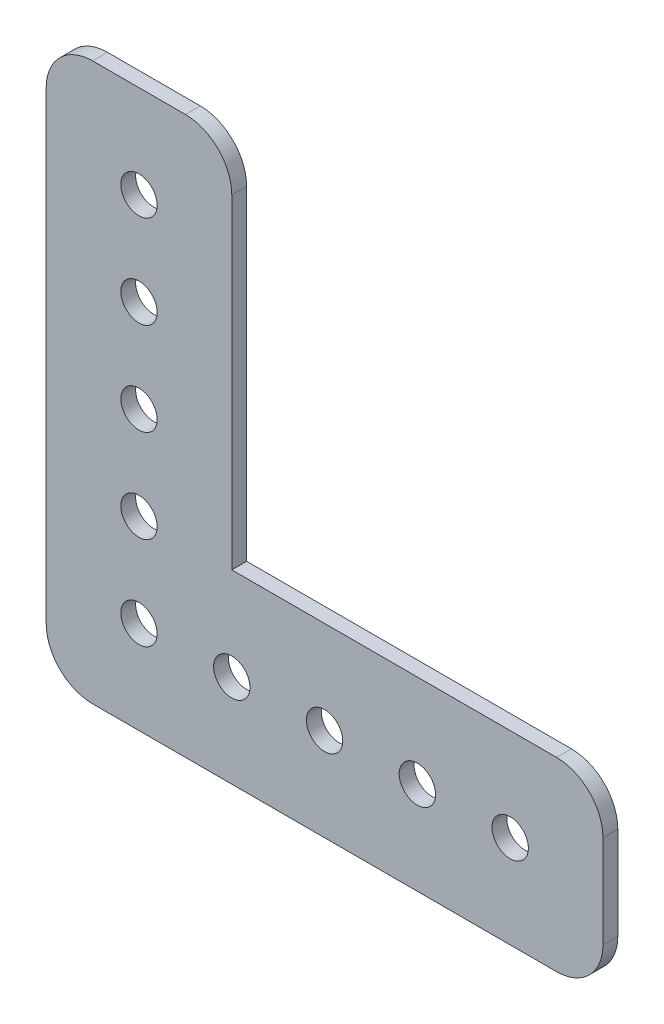
ISO-10303-21;
HEADER;
FILE_DESCRIPTION(('STEP AP214'),'2;1');
FILE_NAME('part.step','',(''),(''),'','','');
FILE_SCHEMA(('AUTOMOTIVE_DESIGN { 1 0 10303 214 1 1 1 1 }'));
ENDSEC;
DATA;
#1=APPLICATION_CONTEXT('core data for automotive mechanical design processes');
#2=APPLICATION_PROTOCOL_DEFINITION('international standard','automotive_design',2000,#1);
#3=PRODUCT_CONTEXT('',#1,'mechanical');
#4=PRODUCT('Part','Part','',(#3));
#5=PRODUCT_RELATED_PRODUCT_CATEGORY('part','',(#4));
#6=PRODUCT_DEFINITION_FORMATION('','',#4);
#7=PRODUCT_DEFINITION_CONTEXT('part definition',#1,'design');
#8=PRODUCT_DEFINITION('design','',#6,#7);
#9=PRODUCT_DEFINITION_SHAPE('','',#8);
#10=(LENGTH_UNIT() NAMED_UNIT(*) SI_UNIT(.MILLI.,.METRE.));
#11=(NAMED_UNIT(*) PLANE_ANGLE_UNIT() SI_UNIT($,.RADIAN.));
#12=(NAMED_UNIT(*) SI_UNIT($,.STERADIAN.) SOLID_ANGLE_UNIT());
#13=UNCERTAINTY_MEASURE_WITH_UNIT(LENGTH_MEASURE(1.E-05),#10,'distance_accuracy_value','');
#14=(GEOMETRIC_REPRESENTATION_CONTEXT(3) GLOBAL_UNCERTAINTY_ASSIGNED_CONTEXT((#13)) GLOBAL_UNIT_ASSIGNED_CONTEXT((#10,
#11,#12)) REPRESENTATION_CONTEXT('',''));
#15=CARTESIAN_POINT('',(0.,0.,0.));
#16=DIRECTION('',(0.,0.,1.));
#17=DIRECTION('',(1.,0.,0.));
#18=AXIS2_PLACEMENT_3D('',#15,#16,#17);
#19=CARTESIAN_POINT('',(29.6333333333334,29.6333333333334,2.032));
#20=DIRECTION('',(0.,0.,1.));
#21=DIRECTION('',(1.,0.,0.));
#22=AXIS2_PLACEMENT_3D('',#19,#20,#21);
#23=PLANE('',#22);
#24=CARTESIAN_POINT('',(63.5,12.7,2.03200000000001));
#25=DIRECTION('',(0.,0.,1.));
#26=DIRECTION('',(1.,0.,0.));
#27=AXIS2_PLACEMENT_3D('',#24,#25,#26);
#28=CIRCLE('',#27,2.4892);
#29=CARTESIAN_POINT('',(65.9892,12.7,2.03200000000001));
#30=VERTEX_POINT('',#29);
#31=EDGE_CURVE('E215',#30,#30,#28,.F.);
#32=ORIENTED_EDGE('',*,*,#31,.T.);
#33=EDGE_LOOP('',(#32));
#34=FACE_BOUND('',#33,.T.);
#35=CARTESIAN_POINT('',(38.1,12.7,2.03200000000001));
#36=DIRECTION('',(0.,0.,1.));
#37=DIRECTION('',(1.,0.,0.));
#38=AXIS2_PLACEMENT_3D('',#35,#36,#37);
#39=CIRCLE('',#38,2.4892);
#40=CARTESIAN_POINT('',(40.5892,12.7,2.03200000000001));
#41=VERTEX_POINT('',#40);
#42=EDGE_CURVE('E212',#41,#41,#39,.F.);
#43=ORIENTED_EDGE('',*,*,#42,.T.);
#44=EDGE_LOOP('',(#43));
#45=FACE_BOUND('',#44,.T.);
#46=CARTESIAN_POINT('',(12.7,63.5,2.03200000000001));
#47=DIRECTION('',(0.,0.,1.));
#48=DIRECTION('',(1.,0.,0.));
#49=AXIS2_PLACEMENT_3D('',#46,#47,#48);
#50=CIRCLE('',#49,2.4892);
#51=CARTESIAN_POINT('',(15.1892,63.5,2.03200000000001));
#52=VERTEX_POINT('',#51);
#53=EDGE_CURVE('E209',#52,#52,#50,.F.);
#54=ORIENTED_EDGE('',*,*,#53,.T.);
#55=EDGE_LOOP('',(#54));
#56=FACE_BOUND('',#55,.T.);
#57=CARTESIAN_POINT('',(12.7,38.1,2.03200000000001));
#58=DIRECTION('',(0.,0.,1.));
#59=DIRECTION('',(1.,0.,0.));
#60=AXIS2_PLACEMENT_3D('',#57,#58,#59);
#61=CIRCLE('',#60,2.4892);
#62=CARTESIAN_POINT('',(15.1892,38.1,2.03200000000001));
#63=VERTEX_POINT('',#62);
#64=EDGE_CURVE('E206',#63,#63,#61,.F.);
#65=ORIENTED_EDGE('',*,*,#64,.T.);
#66=EDGE_LOOP('',(#65));
#67=FACE_BOUND('',#66,.T.);
#68=CARTESIAN_POINT('',(12.7,12.7,2.03200000000001));
#69=DIRECTION('',(0.,0.,1.));
#70=DIRECTION('',(1.,0.,0.));
#71=AXIS2_PLACEMENT_3D('',#68,#69,#70);
#72=CIRCLE('',#71,2.4892);
#73=CARTESIAN_POINT('',(15.1892,12.7,2.03200000000001));
#74=VERTEX_POINT('',#73);
#75=EDGE_CURVE('E203',#74,#74,#72,.F.);
#76=ORIENTED_EDGE('',*,*,#75,.T.);
#77=EDGE_LOOP('',(#76));
#78=FACE_BOUND('',#77,.T.);
#79=CARTESIAN_POINT('',(12.7,25.4,2.03200000000001));
#80=DIRECTION('',(0.,0.,1.));
#81=DIRECTION('',(1.,0.,0.));
#82=AXIS2_PLACEMENT_3D('',#79,#80,#81);
#83=CIRCLE('',#82,2.4892);
#84=CARTESIAN_POINT('',(15.1892,25.4,2.03200000000001));
#85=VERTEX_POINT('',#84);
#86=EDGE_CURVE('E200',#85,#85,#83,.F.);
#87=ORIENTED_EDGE('',*,*,#86,.T.);
#88=EDGE_LOOP('',(#87));
#89=FACE_BOUND('',#88,.T.);
#90=CARTESIAN_POINT('',(12.7,50.8,2.03200000000001));
#91=DIRECTION('',(0.,0.,1.));
#92=DIRECTION('',(1.,0.,0.));
#93=AXIS2_PLACEMENT_3D('',#90,#91,#92);
#94=CIRCLE('',#93,2.4892);
#95=CARTESIAN_POINT('',(15.1892,50.8,2.03200000000001));
#96=VERTEX_POINT('',#95);
#97=EDGE_CURVE('E197',#96,#96,#94,.F.);
#98=ORIENTED_EDGE('',*,*,#97,.T.);
#99=EDGE_LOOP('',(#98));
#100=FACE_BOUND('',#99,.T.);
#101=CARTESIAN_POINT('',(25.4,12.7,2.03200000000001));
#102=DIRECTION('',(0.,0.,1.));
#103=DIRECTION('',(1.,0.,0.));
#104=AXIS2_PLACEMENT_3D('',#101,#102,#103);
#105=CIRCLE('',#104,2.4892);
#106=CARTESIAN_POINT('',(27.8892,12.7,2.03200000000001));
#107=VERTEX_POINT('',#106);
#108=EDGE_CURVE('E194',#107,#107,#105,.F.);
#109=ORIENTED_EDGE('',*,*,#108,.T.);
#110=EDGE_LOOP('',(#109));
#111=FACE_BOUND('',#110,.T.);
#112=CARTESIAN_POINT('',(50.8,12.7,2.03200000000001));
#113=DIRECTION('',(0.,0.,1.));
#114=DIRECTION('',(1.,0.,0.));
#115=AXIS2_PLACEMENT_3D('',#112,#113,#114);
#116=CIRCLE('',#115,2.4892);
#117=CARTESIAN_POINT('',(53.2892,12.7,2.03200000000001));
#118=VERTEX_POINT('',#117);
#119=EDGE_CURVE('E191',#118,#118,#116,.F.);
#120=ORIENTED_EDGE('',*,*,#119,.T.);
#121=EDGE_LOOP('',(#120));
#122=FACE_BOUND('',#121,.T.);
#123=CARTESIAN_POINT('',(69.85,6.35000000000002,2.032));
#124=DIRECTION('',(0.,0.,1.));
#125=DIRECTION('',(1.,0.,0.));
#126=AXIS2_PLACEMENT_3D('',#123,#124,#125);
#127=CIRCLE('',#126,6.35);
#128=CARTESIAN_POINT('',(76.2,6.35000000000003,2.032));
#129=VERTEX_POINT('',#128);
#130=CARTESIAN_POINT('',(69.85,0.,2.032));
#131=VERTEX_POINT('',#130);
#132=EDGE_CURVE('E220',#129,#131,#127,.F.);
#133=ORIENTED_EDGE('',*,*,#132,.F.);
#134=DIRECTION('',(0.,1.,0.));
#135=VECTOR('',#134,1.);
#136=CARTESIAN_POINT('',(76.2,0.,2.032));
#137=LINE('',#136,#135);
#138=CARTESIAN_POINT('',(76.2,19.05,2.032));
#139=VERTEX_POINT('',#138);
#140=EDGE_CURVE('E133',#139,#129,#137,.F.);
#141=ORIENTED_EDGE('',*,*,#140,.F.);
#142=CARTESIAN_POINT('',(69.85,19.05,2.032));
#143=DIRECTION('',(0.,0.,1.));
#144=DIRECTION('',(1.,0.,0.));
#145=AXIS2_PLACEMENT_3D('',#142,#143,#144);
#146=CIRCLE('',#145,6.35);
#147=CARTESIAN_POINT('',(69.85,25.4,2.032));
#148=VERTEX_POINT('',#147);
#149=EDGE_CURVE('E117',#148,#139,#146,.F.);
#150=ORIENTED_EDGE('',*,*,#149,.F.);
#151=DIRECTION('',(-1.,0.,0.));
#152=VECTOR('',#151,1.);
#153=CARTESIAN_POINT('',(76.2,25.4,2.032));
#154=LINE('',#153,#152);
#155=CARTESIAN_POINT('',(25.4,25.4,2.032));
#156=VERTEX_POINT('',#155);
#157=EDGE_CURVE('E112',#156,#148,#154,.F.);
#158=ORIENTED_EDGE('',*,*,#157,.F.);
#159=DIRECTION('',(0.,1.,0.));
#160=VECTOR('',#159,1.);
#161=CARTESIAN_POINT('',(25.4,25.4,2.032));
#162=LINE('',#161,#160);
#163=CARTESIAN_POINT('',(25.4,69.85,2.032));
#164=VERTEX_POINT('',#163);
#165=EDGE_CURVE('E103',#164,#156,#162,.F.);
#166=ORIENTED_EDGE('',*,*,#165,.F.);
#167=CARTESIAN_POINT('',(19.05,69.85,2.032));
#168=DIRECTION('',(0.,0.,1.));
#169=DIRECTION('',(1.,0.,0.));
#170=AXIS2_PLACEMENT_3D('',#167,#168,#169);
#171=CIRCLE('',#170,6.35);
#172=CARTESIAN_POINT('',(19.05,76.2,2.032));
#173=VERTEX_POINT('',#172);
#174=EDGE_CURVE('E18',#173,#164,#171,.F.);
#175=ORIENTED_EDGE('',*,*,#174,.F.);
#176=DIRECTION('',(1.,0.,0.));
#177=VECTOR('',#176,1.);
#178=CARTESIAN_POINT('',(25.4,76.2,2.032));
#179=LINE('',#178,#177);
#180=CARTESIAN_POINT('',(6.35,76.2,2.032));
#181=VERTEX_POINT('',#180);
#182=EDGE_CURVE('E93',#181,#173,#179,.T.);
#183=ORIENTED_EDGE('',*,*,#182,.F.);
#184=CARTESIAN_POINT('',(6.35,69.85,2.032));
#185=DIRECTION('',(0.,0.,1.));
#186=DIRECTION('',(1.,0.,0.));
#187=AXIS2_PLACEMENT_3D('',#184,#185,#186);
#188=CIRCLE('',#187,6.35);
#189=CARTESIAN_POINT('',(0.,69.85,2.032));
#190=VERTEX_POINT('',#189);
#191=EDGE_CURVE('E223',#190,#181,#188,.F.);
#192=ORIENTED_EDGE('',*,*,#191,.F.);
#193=DIRECTION('',(0.,1.,0.));
#194=VECTOR('',#193,1.);
#195=CARTESIAN_POINT('',(0.,76.2,2.032));
#196=LINE('',#195,#194);
#197=CARTESIAN_POINT('',(0.,6.35,2.032));
#198=VERTEX_POINT('',#197);
#199=EDGE_CURVE('E141',#198,#190,#196,.T.);
#200=ORIENTED_EDGE('',*,*,#199,.F.);
#201=CARTESIAN_POINT('',(6.35,6.35,2.032));
#202=DIRECTION('',(0.,0.,1.));
#203=DIRECTION('',(1.,0.,0.));
#204=AXIS2_PLACEMENT_3D('',#201,#202,#203);
#205=CIRCLE('',#204,6.35);
#206=CARTESIAN_POINT('',(6.35,0.,2.032));
#207=VERTEX_POINT('',#206);
#208=EDGE_CURVE('E222',#207,#198,#205,.F.);
#209=ORIENTED_EDGE('',*,*,#208,.F.);
#210=DIRECTION('',(1.,0.,0.));
#211=VECTOR('',#210,1.);
#212=CARTESIAN_POINT('',(0.,0.,2.032));
#213=LINE('',#212,#211);
#214=EDGE_CURVE('E137',#131,#207,#213,.F.);
#215=ORIENTED_EDGE('',*,*,#214,.F.);
#216=EDGE_LOOP('',(#133,#141,#150,#158,#166,#175,#183,#192,#200,#209,#215));
#217=FACE_BOUND('',#216,.T.);
#218=ADVANCED_FACE('F15',(#34,#45,#56,#67,#78,#89,#100,#111,#122,#217),#23,.T.);
#219=CARTESIAN_POINT('',(76.2,25.4,0.));
#220=DIRECTION('',(0.,1.,0.));
#221=DIRECTION('',(-1.,0.,0.));
#222=AXIS2_PLACEMENT_3D('',#219,#220,#221);
#223=PLANE('',#222);
#224=DIRECTION('',(0.,0.,1.));
#225=VECTOR('',#224,1.);
#226=CARTESIAN_POINT('',(25.4,25.4,0.));
#227=LINE('',#226,#225);
#228=CARTESIAN_POINT('',(25.4,25.4,0.));
#229=VERTEX_POINT('',#228);
#230=EDGE_CURVE('E108',#156,#229,#227,.F.);
#231=ORIENTED_EDGE('',*,*,#230,.F.);
#232=ORIENTED_EDGE('',*,*,#157,.T.);
#233=DIRECTION('',(0.,0.,1.));
#234=VECTOR('',#233,1.);
#235=CARTESIAN_POINT('',(69.85,25.4,0.));
#236=LINE('',#235,#234);
#237=CARTESIAN_POINT('',(69.85,25.4,0.));
#238=VERTEX_POINT('',#237);
#239=EDGE_CURVE('E218',#238,#148,#236,.T.);
#240=ORIENTED_EDGE('',*,*,#239,.F.);
#241=DIRECTION('',(1.,0.,0.));
#242=VECTOR('',#241,1.);
#243=CARTESIAN_POINT('',(29.6333333333334,25.4,0.));
#244=LINE('',#243,#242);
#245=EDGE_CURVE('E124',#238,#229,#244,.F.);
#246=ORIENTED_EDGE('',*,*,#245,.T.);
#247=EDGE_LOOP('',(#231,#232,#240,#246));
#248=FACE_BOUND('',#247,.T.);
#249=ADVANCED_FACE('F123',(#248),#223,.T.);
#250=CARTESIAN_POINT('',(25.4,25.4,0.));
#251=DIRECTION('',(1.,0.,0.));
#252=DIRECTION('',(0.,1.,0.));
#253=AXIS2_PLACEMENT_3D('',#250,#251,#252);
#254=PLANE('',#253);
#255=ORIENTED_EDGE('',*,*,#230,.T.);
#256=DIRECTION('',(0.,1.,0.));
#257=VECTOR('',#256,1.);
#258=CARTESIAN_POINT('',(25.4,29.6333333333334,0.));
#259=LINE('',#258,#257);
#260=CARTESIAN_POINT('',(25.4,69.85,0.));
#261=VERTEX_POINT('',#260);
#262=EDGE_CURVE('E190',#229,#261,#259,.T.);
#263=ORIENTED_EDGE('',*,*,#262,.T.);
#264=DIRECTION('',(0.,0.,1.));
#265=VECTOR('',#264,1.);
#266=CARTESIAN_POINT('',(25.4,69.85,0.));
#267=LINE('',#266,#265);
#268=EDGE_CURVE('E110',#164,#261,#267,.F.);
#269=ORIENTED_EDGE('',*,*,#268,.F.);
#270=ORIENTED_EDGE('',*,*,#165,.T.);
#271=EDGE_LOOP('',(#255,#263,#269,#270));
#272=FACE_BOUND('',#271,.T.);
#273=ADVANCED_FACE('F105',(#272),#254,.T.);
#274=CARTESIAN_POINT('',(19.05,69.85,0.));
#275=DIRECTION('',(0.,0.,1.));
#276=DIRECTION('',(1.,0.,0.));
#277=AXIS2_PLACEMENT_3D('',#274,#275,#276);
#278=CYLINDRICAL_SURFACE('',#277,6.35);
#279=CARTESIAN_POINT('',(19.05,69.85,0.));
#280=DIRECTION('',(0.,0.,1.));
#281=DIRECTION('',(1.,0.,0.));
#282=AXIS2_PLACEMENT_3D('',#279,#280,#281);
#283=CIRCLE('',#282,6.35);
#284=CARTESIAN_POINT('',(19.05,76.2,0.));
#285=VERTEX_POINT('',#284);
#286=EDGE_CURVE('E187',#261,#285,#283,.T.);
#287=ORIENTED_EDGE('',*,*,#286,.T.);
#288=DIRECTION('',(0.,0.,1.));
#289=VECTOR('',#288,1.);
#290=CARTESIAN_POINT('',(19.05,76.2,0.));
#291=LINE('',#290,#289);
#292=EDGE_CURVE('E145',#173,#285,#291,.F.);
#293=ORIENTED_EDGE('',*,*,#292,.F.);
#294=ORIENTED_EDGE('',*,*,#174,.T.);
#295=ORIENTED_EDGE('',*,*,#268,.T.);
#296=EDGE_LOOP('',(#287,#293,#294,#295));
#297=FACE_BOUND('',#296,.T.);
#298=ADVANCED_FACE('F278',(#297),#278,.T.);
#299=CARTESIAN_POINT('',(25.4,76.2,0.));
#300=DIRECTION('',(0.,1.,0.));
#301=DIRECTION('',(0.,0.,1.));
#302=AXIS2_PLACEMENT_3D('',#299,#300,#301);
#303=PLANE('',#302);
#304=ORIENTED_EDGE('',*,*,#292,.T.);
#305=DIRECTION('',(1.,0.,0.));
#306=VECTOR('',#305,1.);
#307=CARTESIAN_POINT('',(29.6333333333334,76.2,0.));
#308=LINE('',#307,#306);
#309=CARTESIAN_POINT('',(6.35,76.2,0.));
#310=VERTEX_POINT('',#309);
#311=EDGE_CURVE('E186',#285,#310,#308,.F.);
#312=ORIENTED_EDGE('',*,*,#311,.T.);
#313=DIRECTION('',(0.,0.,1.));
#314=VECTOR('',#313,1.);
#315=CARTESIAN_POINT('',(6.35,76.2,0.));
#316=LINE('',#315,#314);
#317=EDGE_CURVE('E144',#181,#310,#316,.F.);
#318=ORIENTED_EDGE('',*,*,#317,.F.);
#319=ORIENTED_EDGE('',*,*,#182,.T.);
#320=EDGE_LOOP('',(#304,#312,#318,#319));
#321=FACE_BOUND('',#320,.T.);
#322=ADVANCED_FACE('F276',(#321),#303,.T.);
#323=CARTESIAN_POINT('',(6.35,69.85,0.));
#324=DIRECTION('',(0.,0.,1.));
#325=DIRECTION('',(1.,0.,0.));
#326=AXIS2_PLACEMENT_3D('',#323,#324,#325);
#327=CYLINDRICAL_SURFACE('',#326,6.35);
#328=CARTESIAN_POINT('',(6.35,69.85,0.));
#329=DIRECTION('',(0.,0.,1.));
#330=DIRECTION('',(1.,0.,0.));
#331=AXIS2_PLACEMENT_3D('',#328,#329,#330);
#332=CIRCLE('',#331,6.35);
#333=CARTESIAN_POINT('',(0.,69.85,0.));
#334=VERTEX_POINT('',#333);
#335=EDGE_CURVE('E183',#310,#334,#332,.T.);
#336=ORIENTED_EDGE('',*,*,#335,.T.);
#337=DIRECTION('',(0.,0.,1.));
#338=VECTOR('',#337,1.);
#339=CARTESIAN_POINT('',(0.,69.85,0.));
#340=LINE('',#339,#338);
#341=EDGE_CURVE('E143',#190,#334,#340,.F.);
#342=ORIENTED_EDGE('',*,*,#341,.F.);
#343=ORIENTED_EDGE('',*,*,#191,.T.);
#344=ORIENTED_EDGE('',*,*,#317,.T.);
#345=EDGE_LOOP('',(#336,#342,#343,#344));
#346=FACE_BOUND('',#345,.T.);
#347=ADVANCED_FACE('F275',(#346),#327,.T.);
#348=CARTESIAN_POINT('',(0.,76.2,0.));
#349=DIRECTION('',(-1.,0.,0.));
#350=DIRECTION('',(0.,0.,1.));
#351=AXIS2_PLACEMENT_3D('',#348,#349,#350);
#352=PLANE('',#351);
#353=ORIENTED_EDGE('',*,*,#341,.T.);
#354=DIRECTION('',(0.,1.,0.));
#355=VECTOR('',#354,1.);
#356=CARTESIAN_POINT('',(0.,29.6333333333334,0.));
#357=LINE('',#356,#355);
#358=CARTESIAN_POINT('',(0.,6.35,0.));
#359=VERTEX_POINT('',#358);
#360=EDGE_CURVE('E182',#334,#359,#357,.F.);
#361=ORIENTED_EDGE('',*,*,#360,.T.);
#362=DIRECTION('',(0.,0.,1.));
#363=VECTOR('',#362,1.);
#364=CARTESIAN_POINT('',(0.,6.35,0.));
#365=LINE('',#364,#363);
#366=EDGE_CURVE('E140',#198,#359,#365,.F.);
#367=ORIENTED_EDGE('',*,*,#366,.F.);
#368=ORIENTED_EDGE('',*,*,#199,.T.);
#369=EDGE_LOOP('',(#353,#361,#367,#368));
#370=FACE_BOUND('',#369,.T.);
#371=ADVANCED_FACE('F273',(#370),#352,.T.);
#372=CARTESIAN_POINT('',(6.35,6.35,0.));
#373=DIRECTION('',(0.,0.,1.));
#374=DIRECTION('',(1.,0.,0.));
#375=AXIS2_PLACEMENT_3D('',#372,#373,#374);
#376=CYLINDRICAL_SURFACE('',#375,6.35);
#377=CARTESIAN_POINT('',(6.35,6.35,0.));
#378=DIRECTION('',(0.,0.,1.));
#379=DIRECTION('',(1.,0.,0.));
#380=AXIS2_PLACEMENT_3D('',#377,#378,#379);
#381=CIRCLE('',#380,6.35);
#382=CARTESIAN_POINT('',(6.35,0.,0.));
#383=VERTEX_POINT('',#382);
#384=EDGE_CURVE('E179',#359,#383,#381,.T.);
#385=ORIENTED_EDGE('',*,*,#384,.T.);
#386=DIRECTION('',(0.,0.,1.));
#387=VECTOR('',#386,1.);
#388=CARTESIAN_POINT('',(6.35,0.,0.));
#389=LINE('',#388,#387);
#390=EDGE_CURVE('E139',#207,#383,#389,.F.);
#391=ORIENTED_EDGE('',*,*,#390,.F.);
#392=ORIENTED_EDGE('',*,*,#208,.T.);
#393=ORIENTED_EDGE('',*,*,#366,.T.);
#394=EDGE_LOOP('',(#385,#391,#392,#393));
#395=FACE_BOUND('',#394,.T.);
#396=ADVANCED_FACE('F269',(#395),#376,.T.);
#397=CARTESIAN_POINT('',(0.,0.,0.));
#398=DIRECTION('',(0.,-1.,0.));
#399=DIRECTION('',(1.,0.,0.));
#400=AXIS2_PLACEMENT_3D('',#397,#398,#399);
#401=PLANE('',#400);
#402=ORIENTED_EDGE('',*,*,#390,.T.);
#403=DIRECTION('',(1.,0.,0.));
#404=VECTOR('',#403,1.);
#405=CARTESIAN_POINT('',(29.6333333333334,0.,0.));
#406=LINE('',#405,#404);
#407=CARTESIAN_POINT('',(69.85,0.,0.));
#408=VERTEX_POINT('',#407);
#409=EDGE_CURVE('E178',#383,#408,#406,.T.);
#410=ORIENTED_EDGE('',*,*,#409,.T.);
#411=DIRECTION('',(0.,0.,1.));
#412=VECTOR('',#411,1.);
#413=CARTESIAN_POINT('',(69.85,0.,0.));
#414=LINE('',#413,#412);
#415=EDGE_CURVE('E136',#131,#408,#414,.F.);
#416=ORIENTED_EDGE('',*,*,#415,.F.);
#417=ORIENTED_EDGE('',*,*,#214,.T.);
#418=EDGE_LOOP('',(#402,#410,#416,#417));
#419=FACE_BOUND('',#418,.T.);
#420=ADVANCED_FACE('F263',(#419),#401,.T.);
#421=CARTESIAN_POINT('',(69.85,6.35000000000002,0.));
#422=DIRECTION('',(0.,0.,1.));
#423=DIRECTION('',(1.,0.,0.));
#424=AXIS2_PLACEMENT_3D('',#421,#422,#423);
#425=CYLINDRICAL_SURFACE('',#424,6.35);
#426=CARTESIAN_POINT('',(69.85,6.35000000000002,0.));
#427=DIRECTION('',(0.,0.,1.));
#428=DIRECTION('',(1.,0.,0.));
#429=AXIS2_PLACEMENT_3D('',#426,#427,#428);
#430=CIRCLE('',#429,6.35);
#431=CARTESIAN_POINT('',(76.2,6.35000000000003,0.));
#432=VERTEX_POINT('',#431);
#433=EDGE_CURVE('E175',#408,#432,#430,.T.);
#434=ORIENTED_EDGE('',*,*,#433,.T.);
#435=DIRECTION('',(0.,0.,1.));
#436=VECTOR('',#435,1.);
#437=CARTESIAN_POINT('',(76.2,6.35000000000002,0.));
#438=LINE('',#437,#436);
#439=EDGE_CURVE('E135',#129,#432,#438,.F.);
#440=ORIENTED_EDGE('',*,*,#439,.F.);
#441=ORIENTED_EDGE('',*,*,#132,.T.);
#442=ORIENTED_EDGE('',*,*,#415,.T.);
#443=EDGE_LOOP('',(#434,#440,#441,#442));
#444=FACE_BOUND('',#443,.T.);
#445=ADVANCED_FACE('F259',(#444),#425,.T.);
#446=CARTESIAN_POINT('',(76.2,0.,0.));
#447=DIRECTION('',(1.,0.,0.));
#448=DIRECTION('',(0.,1.,0.));
#449=AXIS2_PLACEMENT_3D('',#446,#447,#448);
#450=PLANE('',#449);
#451=ORIENTED_EDGE('',*,*,#439,.T.);
#452=DIRECTION('',(0.,1.,0.));
#453=VECTOR('',#452,1.);
#454=CARTESIAN_POINT('',(76.2,29.6333333333334,0.));
#455=LINE('',#454,#453);
#456=CARTESIAN_POINT('',(76.2,19.05,0.));
#457=VERTEX_POINT('',#456);
#458=EDGE_CURVE('E174',#432,#457,#455,.T.);
#459=ORIENTED_EDGE('',*,*,#458,.T.);
#460=DIRECTION('',(0.,0.,1.));
#461=VECTOR('',#460,1.);
#462=CARTESIAN_POINT('',(76.2,19.05,0.));
#463=LINE('',#462,#461);
#464=EDGE_CURVE('E33',#139,#457,#463,.F.);
#465=ORIENTED_EDGE('',*,*,#464,.F.);
#466=ORIENTED_EDGE('',*,*,#140,.T.);
#467=EDGE_LOOP('',(#451,#459,#465,#466));
#468=FACE_BOUND('',#467,.T.);
#469=ADVANCED_FACE('F252',(#468),#450,.T.);
#470=CARTESIAN_POINT('',(69.85,19.05,0.));
#471=DIRECTION('',(0.,0.,1.));
#472=DIRECTION('',(1.,0.,0.));
#473=AXIS2_PLACEMENT_3D('',#470,#471,#472);
#474=CYLINDRICAL_SURFACE('',#473,6.35);
#475=CARTESIAN_POINT('',(69.85,19.05,0.));
#476=DIRECTION('',(0.,0.,1.));
#477=DIRECTION('',(1.,0.,0.));
#478=AXIS2_PLACEMENT_3D('',#475,#476,#477);
#479=CIRCLE('',#478,6.35);
#480=EDGE_CURVE('E172',#457,#238,#479,.T.);
#481=ORIENTED_EDGE('',*,*,#480,.T.);
#482=ORIENTED_EDGE('',*,*,#239,.T.);
#483=ORIENTED_EDGE('',*,*,#149,.T.);
#484=ORIENTED_EDGE('',*,*,#464,.T.);
#485=EDGE_LOOP('',(#481,#482,#483,#484));
#486=FACE_BOUND('',#485,.T.);
#487=ADVANCED_FACE('F331',(#486),#474,.T.);
#488=CARTESIAN_POINT('',(63.5,12.7,-105.750229629935));
#489=DIRECTION('',(0.,0.,1.));
#490=DIRECTION('',(1.,0.,0.));
#491=AXIS2_PLACEMENT_3D('',#488,#489,#490);
#492=CYLINDRICAL_SURFACE('',#491,2.4892);
#493=ORIENTED_EDGE('',*,*,#31,.F.);
#494=EDGE_LOOP('',(#493));
#495=FACE_BOUND('',#494,.T.);
#496=CARTESIAN_POINT('',(63.5,12.7,0.));
#497=DIRECTION('',(0.,0.,1.));
#498=DIRECTION('',(1.,0.,0.));
#499=AXIS2_PLACEMENT_3D('',#496,#497,#498);
#500=CIRCLE('',#499,2.4892);
#501=CARTESIAN_POINT('',(65.9892,12.7,0.));
#502=VERTEX_POINT('',#501);
#503=EDGE_CURVE('E169',#502,#502,#500,.F.);
#504=ORIENTED_EDGE('',*,*,#503,.T.);
#505=EDGE_LOOP('',(#504));
#506=FACE_BOUND('',#505,.T.);
#507=ADVANCED_FACE('F327',(#495,#506),#492,.F.);
#508=CARTESIAN_POINT('',(38.1,12.7,-105.750229629935));
#509=DIRECTION('',(0.,0.,1.));
#510=DIRECTION('',(1.,0.,0.));
#511=AXIS2_PLACEMENT_3D('',#508,#509,#510);
#512=CYLINDRICAL_SURFACE('',#511,2.4892);
#513=ORIENTED_EDGE('',*,*,#42,.F.);
#514=EDGE_LOOP('',(#513));
#515=FACE_BOUND('',#514,.T.);
#516=CARTESIAN_POINT('',(38.1,12.7,0.));
#517=DIRECTION('',(0.,0.,1.));
#518=DIRECTION('',(1.,0.,0.));
#519=AXIS2_PLACEMENT_3D('',#516,#517,#518);
#520=CIRCLE('',#519,2.4892);
#521=CARTESIAN_POINT('',(40.5892,12.7,0.));
#522=VERTEX_POINT('',#521);
#523=EDGE_CURVE('E166',#522,#522,#520,.F.);
#524=ORIENTED_EDGE('',*,*,#523,.T.);
#525=EDGE_LOOP('',(#524));
#526=FACE_BOUND('',#525,.T.);
#527=ADVANCED_FACE('F323',(#515,#526),#512,.F.);
#528=CARTESIAN_POINT('',(12.7,63.5,-105.750229629935));
#529=DIRECTION('',(0.,0.,1.));
#530=DIRECTION('',(1.,0.,0.));
#531=AXIS2_PLACEMENT_3D('',#528,#529,#530);
#532=CYLINDRICAL_SURFACE('',#531,2.4892);
#533=ORIENTED_EDGE('',*,*,#53,.F.);
#534=EDGE_LOOP('',(#533));
#535=FACE_BOUND('',#534,.T.);
#536=CARTESIAN_POINT('',(12.7,63.5,0.));
#537=DIRECTION('',(0.,0.,1.));
#538=DIRECTION('',(1.,0.,0.));
#539=AXIS2_PLACEMENT_3D('',#536,#537,#538);
#540=CIRCLE('',#539,2.4892);
#541=CARTESIAN_POINT('',(15.1892,63.5,0.));
#542=VERTEX_POINT('',#541);
#543=EDGE_CURVE('E163',#542,#542,#540,.F.);
#544=ORIENTED_EDGE('',*,*,#543,.T.);
#545=EDGE_LOOP('',(#544));
#546=FACE_BOUND('',#545,.T.);
#547=ADVANCED_FACE('F319',(#535,#546),#532,.F.);
#548=CARTESIAN_POINT('',(12.7,38.1,-105.750229629935));
#549=DIRECTION('',(0.,0.,1.));
#550=DIRECTION('',(1.,0.,0.));
#551=AXIS2_PLACEMENT_3D('',#548,#549,#550);
#552=CYLINDRICAL_SURFACE('',#551,2.4892);
#553=ORIENTED_EDGE('',*,*,#64,.F.);
#554=EDGE_LOOP('',(#553));
#555=FACE_BOUND('',#554,.T.);
#556=CARTESIAN_POINT('',(12.7,38.1,0.));
#557=DIRECTION('',(0.,0.,1.));
#558=DIRECTION('',(1.,0.,0.));
#559=AXIS2_PLACEMENT_3D('',#556,#557,#558);
#560=CIRCLE('',#559,2.4892);
#561=CARTESIAN_POINT('',(15.1892,38.1,0.));
#562=VERTEX_POINT('',#561);
#563=EDGE_CURVE('E160',#562,#562,#560,.F.);
#564=ORIENTED_EDGE('',*,*,#563,.T.);
#565=EDGE_LOOP('',(#564));
#566=FACE_BOUND('',#565,.T.);
#567=ADVANCED_FACE('F315',(#555,#566),#552,.F.);
#568=CARTESIAN_POINT('',(12.7,12.7,-105.750229629935));
#569=DIRECTION('',(0.,0.,1.));
#570=DIRECTION('',(1.,0.,0.));
#571=AXIS2_PLACEMENT_3D('',#568,#569,#570);
#572=CYLINDRICAL_SURFACE('',#571,2.4892);
#573=ORIENTED_EDGE('',*,*,#75,.F.);
#574=EDGE_LOOP('',(#573));
#575=FACE_BOUND('',#574,.T.);
#576=CARTESIAN_POINT('',(12.7,12.7,0.));
#577=DIRECTION('',(0.,0.,1.));
#578=DIRECTION('',(1.,0.,0.));
#579=AXIS2_PLACEMENT_3D('',#576,#577,#578);
#580=CIRCLE('',#579,2.4892);
#581=CARTESIAN_POINT('',(15.1892,12.7,0.));
#582=VERTEX_POINT('',#581);
#583=EDGE_CURVE('E157',#582,#582,#580,.F.);
#584=ORIENTED_EDGE('',*,*,#583,.T.);
#585=EDGE_LOOP('',(#584));
#586=FACE_BOUND('',#585,.T.);
#587=ADVANCED_FACE('F311',(#575,#586),#572,.F.);
#588=CARTESIAN_POINT('',(12.7,25.4,-105.750229629935));
#589=DIRECTION('',(0.,0.,1.));
#590=DIRECTION('',(1.,0.,0.));
#591=AXIS2_PLACEMENT_3D('',#588,#589,#590);
#592=CYLINDRICAL_SURFACE('',#591,2.4892);
#593=ORIENTED_EDGE('',*,*,#86,.F.);
#594=EDGE_LOOP('',(#593));
#595=FACE_BOUND('',#594,.T.);
#596=CARTESIAN_POINT('',(12.7,25.4,0.));
#597=DIRECTION('',(0.,0.,1.));
#598=DIRECTION('',(1.,0.,0.));
#599=AXIS2_PLACEMENT_3D('',#596,#597,#598);
#600=CIRCLE('',#599,2.4892);
#601=CARTESIAN_POINT('',(15.1892,25.4,0.));
#602=VERTEX_POINT('',#601);
#603=EDGE_CURVE('E154',#602,#602,#600,.F.);
#604=ORIENTED_EDGE('',*,*,#603,.T.);
#605=EDGE_LOOP('',(#604));
#606=FACE_BOUND('',#605,.T.);
#607=ADVANCED_FACE('F307',(#595,#606),#592,.F.);
#608=CARTESIAN_POINT('',(12.7,50.8,-105.750229629935));
#609=DIRECTION('',(0.,0.,1.));
#610=DIRECTION('',(1.,0.,0.));
#611=AXIS2_PLACEMENT_3D('',#608,#609,#610);
#612=CYLINDRICAL_SURFACE('',#611,2.4892);
#613=ORIENTED_EDGE('',*,*,#97,.F.);
#614=EDGE_LOOP('',(#613));
#615=FACE_BOUND('',#614,.T.);
#616=CARTESIAN_POINT('',(12.7,50.8,0.));
#617=DIRECTION('',(0.,0.,1.));
#618=DIRECTION('',(1.,0.,0.));
#619=AXIS2_PLACEMENT_3D('',#616,#617,#618);
#620=CIRCLE('',#619,2.4892);
#621=CARTESIAN_POINT('',(15.1892,50.8,0.));
#622=VERTEX_POINT('',#621);
#623=EDGE_CURVE('E151',#622,#622,#620,.F.);
#624=ORIENTED_EDGE('',*,*,#623,.T.);
#625=EDGE_LOOP('',(#624));
#626=FACE_BOUND('',#625,.T.);
#627=ADVANCED_FACE('F303',(#615,#626),#612,.F.);
#628=CARTESIAN_POINT('',(25.4,12.7,-105.750229629935));
#629=DIRECTION('',(0.,0.,1.));
#630=DIRECTION('',(1.,0.,0.));
#631=AXIS2_PLACEMENT_3D('',#628,#629,#630);
#632=CYLINDRICAL_SURFACE('',#631,2.4892);
#633=ORIENTED_EDGE('',*,*,#108,.F.);
#634=EDGE_LOOP('',(#633));
#635=FACE_BOUND('',#634,.T.);
#636=CARTESIAN_POINT('',(25.4,12.7,0.));
#637=DIRECTION('',(0.,0.,1.));
#638=DIRECTION('',(1.,0.,0.));
#639=AXIS2_PLACEMENT_3D('',#636,#637,#638);
#640=CIRCLE('',#639,2.4892);
#641=CARTESIAN_POINT('',(27.8892,12.7,0.));
#642=VERTEX_POINT('',#641);
#643=EDGE_CURVE('E24',#642,#642,#640,.F.);
#644=ORIENTED_EDGE('',*,*,#643,.T.);
#645=EDGE_LOOP('',(#644));
#646=FACE_BOUND('',#645,.T.);
#647=ADVANCED_FACE('F295',(#635,#646),#632,.F.);
#648=CARTESIAN_POINT('',(50.8,12.7,-105.750229629935));
#649=DIRECTION('',(0.,0.,1.));
#650=DIRECTION('',(1.,0.,0.));
#651=AXIS2_PLACEMENT_3D('',#648,#649,#650);
#652=CYLINDRICAL_SURFACE('',#651,2.4892);
#653=ORIENTED_EDGE('',*,*,#119,.F.);
#654=EDGE_LOOP('',(#653));
#655=FACE_BOUND('',#654,.T.);
#656=CARTESIAN_POINT('',(50.8,12.7,0.));
#657=DIRECTION('',(0.,0.,1.));
#658=DIRECTION('',(1.,0.,0.));
#659=AXIS2_PLACEMENT_3D('',#656,#657,#658);
#660=CIRCLE('',#659,2.4892);
#661=CARTESIAN_POINT('',(53.2892,12.7,0.));
#662=VERTEX_POINT('',#661);
#663=EDGE_CURVE('E9',#662,#662,#660,.F.);
#664=ORIENTED_EDGE('',*,*,#663,.T.);
#665=EDGE_LOOP('',(#664));
#666=FACE_BOUND('',#665,.T.);
#667=ADVANCED_FACE('F289',(#655,#666),#652,.F.);
#668=CARTESIAN_POINT('',(29.6333333333334,29.6333333333334,0.));
#669=DIRECTION('',(0.,0.,1.));
#670=DIRECTION('',(1.,0.,0.));
#671=AXIS2_PLACEMENT_3D('',#668,#669,#670);
#672=PLANE('',#671);
#673=ORIENTED_EDGE('',*,*,#663,.F.);
#674=EDGE_LOOP('',(#673));
#675=FACE_BOUND('',#674,.T.);
#676=ORIENTED_EDGE('',*,*,#643,.F.);
#677=EDGE_LOOP('',(#676));
#678=FACE_BOUND('',#677,.T.);
#679=ORIENTED_EDGE('',*,*,#623,.F.);
#680=EDGE_LOOP('',(#679));
#681=FACE_BOUND('',#680,.T.);
#682=ORIENTED_EDGE('',*,*,#603,.F.);
#683=EDGE_LOOP('',(#682));
#684=FACE_BOUND('',#683,.T.);
#685=ORIENTED_EDGE('',*,*,#583,.F.);
#686=EDGE_LOOP('',(#685));
#687=FACE_BOUND('',#686,.T.);
#688=ORIENTED_EDGE('',*,*,#563,.F.);
#689=EDGE_LOOP('',(#688));
#690=FACE_BOUND('',#689,.T.);
#691=ORIENTED_EDGE('',*,*,#543,.F.);
#692=EDGE_LOOP('',(#691));
#693=FACE_BOUND('',#692,.T.);
#694=ORIENTED_EDGE('',*,*,#523,.F.);
#695=EDGE_LOOP('',(#694));
#696=FACE_BOUND('',#695,.T.);
#697=ORIENTED_EDGE('',*,*,#503,.F.);
#698=EDGE_LOOP('',(#697));
#699=FACE_BOUND('',#698,.T.);
#700=ORIENTED_EDGE('',*,*,#458,.F.);
#701=ORIENTED_EDGE('',*,*,#433,.F.);
#702=ORIENTED_EDGE('',*,*,#409,.F.);
#703=ORIENTED_EDGE('',*,*,#384,.F.);
#704=ORIENTED_EDGE('',*,*,#360,.F.);
#705=ORIENTED_EDGE('',*,*,#335,.F.);
#706=ORIENTED_EDGE('',*,*,#311,.F.);
#707=ORIENTED_EDGE('',*,*,#286,.F.);
#708=ORIENTED_EDGE('',*,*,#262,.F.);
#709=ORIENTED_EDGE('',*,*,#245,.F.);
#710=ORIENTED_EDGE('',*,*,#480,.F.);
#711=EDGE_LOOP('',(#700,#701,#702,#703,#704,#705,#706,#707,#708,#709,#710));
#712=FACE_BOUND('',#711,.T.);
#713=ADVANCED_FACE('F256',(#675,#678,#681,#684,#687,#690,#693,#696,#699,#712),#672,.F.);
#714=CLOSED_SHELL('',(#218,#249,#273,#298,#322,#347,#371,#396,#420,#445,#469,#487,#507,#527,
#547,#567,#587,#607,#627,#647,#667,#713));
#715=MANIFOLD_SOLID_BREP('B1',#714);
#716=ADVANCED_BREP_SHAPE_REPRESENTATION('',(#18,#715),#14);
#717=SHAPE_DEFINITION_REPRESENTATION(#9,#716);
ENDSEC;
END-ISO-10303-21;
